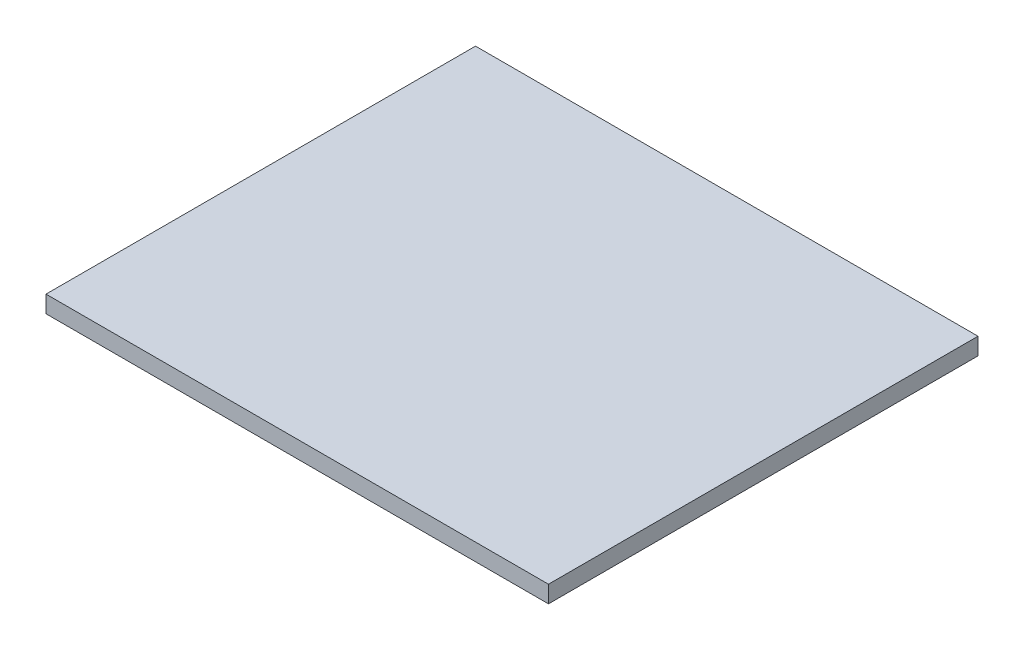
ISO-10303-21;
HEADER;
FILE_DESCRIPTION(('STEP AP214'),'2;1');
FILE_NAME('part.step','',(''),(''),'','','');
FILE_SCHEMA(('AUTOMOTIVE_DESIGN { 1 0 10303 214 1 1 1 1 }'));
ENDSEC;
DATA;
#1=APPLICATION_CONTEXT('core data for automotive mechanical design processes');
#2=APPLICATION_PROTOCOL_DEFINITION('international standard','automotive_design',2000,#1);
#3=PRODUCT_CONTEXT('',#1,'mechanical');
#4=PRODUCT('Part','Part','',(#3));
#5=PRODUCT_RELATED_PRODUCT_CATEGORY('part','',(#4));
#6=PRODUCT_DEFINITION_FORMATION('','',#4);
#7=PRODUCT_DEFINITION_CONTEXT('part definition',#1,'design');
#8=PRODUCT_DEFINITION('design','',#6,#7);
#9=PRODUCT_DEFINITION_SHAPE('','',#8);
#10=(LENGTH_UNIT() NAMED_UNIT(*) SI_UNIT(.MILLI.,.METRE.));
#11=(NAMED_UNIT(*) PLANE_ANGLE_UNIT() SI_UNIT($,.RADIAN.));
#12=(NAMED_UNIT(*) SI_UNIT($,.STERADIAN.) SOLID_ANGLE_UNIT());
#13=UNCERTAINTY_MEASURE_WITH_UNIT(LENGTH_MEASURE(1.E-05),#10,'distance_accuracy_value','');
#14=(GEOMETRIC_REPRESENTATION_CONTEXT(3) GLOBAL_UNCERTAINTY_ASSIGNED_CONTEXT((#13)) GLOBAL_UNIT_ASSIGNED_CONTEXT((#10,
#11,#12)) REPRESENTATION_CONTEXT('',''));
#15=CARTESIAN_POINT('',(0.,0.,0.));
#16=DIRECTION('',(0.,0.,1.));
#17=DIRECTION('',(1.,0.,0.));
#18=AXIS2_PLACEMENT_3D('',#15,#16,#17);
#19=CARTESIAN_POINT('',(-280.,20.,-239.354838709677));
#20=DIRECTION('',(1.,0.,0.));
#21=DIRECTION('',(0.,0.,-1.));
#22=AXIS2_PLACEMENT_3D('',#19,#20,#21);
#23=PLANE('',#22);
#24=DIRECTION('',(0.,0.,1.));
#25=VECTOR('',#24,1.);
#26=CARTESIAN_POINT('',(-280.,0.,-239.354838709677));
#27=LINE('',#26,#25);
#28=CARTESIAN_POINT('',(-280.,0.,-239.354838709677));
#29=VERTEX_POINT('',#28);
#30=CARTESIAN_POINT('',(-280.,0.,265.));
#31=VERTEX_POINT('',#30);
#32=EDGE_CURVE('E107',#29,#31,#27,.T.);
#33=ORIENTED_EDGE('',*,*,#32,.T.);
#34=DIRECTION('',(0.,-1.,0.));
#35=VECTOR('',#34,1.);
#36=CARTESIAN_POINT('',(-280.,20.,265.));
#37=LINE('',#36,#35);
#38=CARTESIAN_POINT('',(-280.,20.,265.));
#39=VERTEX_POINT('',#38);
#40=EDGE_CURVE('E11',#39,#31,#37,.T.);
#41=ORIENTED_EDGE('',*,*,#40,.F.);
#42=DIRECTION('',(0.,0.,1.));
#43=VECTOR('',#42,1.);
#44=CARTESIAN_POINT('',(-280.,20.,-239.354838709677));
#45=LINE('',#44,#43);
#46=CARTESIAN_POINT('',(-280.,20.,-239.354838709677));
#47=VERTEX_POINT('',#46);
#48=EDGE_CURVE('E91',#47,#39,#45,.T.);
#49=ORIENTED_EDGE('',*,*,#48,.F.);
#50=DIRECTION('',(0.,-1.,0.));
#51=VECTOR('',#50,1.);
#52=CARTESIAN_POINT('',(-280.,20.,-239.354838709677));
#53=LINE('',#52,#51);
#54=EDGE_CURVE('E103',#47,#29,#53,.T.);
#55=ORIENTED_EDGE('',*,*,#54,.T.);
#56=EDGE_LOOP('',(#33,#41,#49,#55));
#57=FACE_BOUND('',#56,.T.);
#58=ADVANCED_FACE('F39',(#57),#23,.F.);
#59=CARTESIAN_POINT('',(310.,20.,265.));
#60=DIRECTION('',(0.,0.,-1.));
#61=DIRECTION('',(-1.,0.,0.));
#62=AXIS2_PLACEMENT_3D('',#59,#60,#61);
#63=PLANE('',#62);
#64=DIRECTION('',(1.,0.,0.));
#65=VECTOR('',#64,1.);
#66=CARTESIAN_POINT('',(310.,0.,265.));
#67=LINE('',#66,#65);
#68=CARTESIAN_POINT('',(310.,0.,265.));
#69=VERTEX_POINT('',#68);
#70=EDGE_CURVE('E96',#31,#69,#67,.T.);
#71=ORIENTED_EDGE('',*,*,#70,.T.);
#72=DIRECTION('',(0.,-1.,0.));
#73=VECTOR('',#72,1.);
#74=CARTESIAN_POINT('',(310.,20.,265.));
#75=LINE('',#74,#73);
#76=CARTESIAN_POINT('',(310.,20.,265.));
#77=VERTEX_POINT('',#76);
#78=EDGE_CURVE('E48',#77,#69,#75,.T.);
#79=ORIENTED_EDGE('',*,*,#78,.F.);
#80=DIRECTION('',(1.,0.,0.));
#81=VECTOR('',#80,1.);
#82=CARTESIAN_POINT('',(310.,20.,265.));
#83=LINE('',#82,#81);
#84=EDGE_CURVE('E86',#39,#77,#83,.T.);
#85=ORIENTED_EDGE('',*,*,#84,.F.);
#86=ORIENTED_EDGE('',*,*,#40,.T.);
#87=EDGE_LOOP('',(#71,#79,#85,#86));
#88=FACE_BOUND('',#87,.T.);
#89=ADVANCED_FACE('F95',(#88),#63,.F.);
#90=CARTESIAN_POINT('',(310.,20.,265.));
#91=DIRECTION('',(-1.,0.,0.));
#92=DIRECTION('',(0.,0.,1.));
#93=AXIS2_PLACEMENT_3D('',#90,#91,#92);
#94=PLANE('',#93);
#95=DIRECTION('',(0.,0.,-1.));
#96=VECTOR('',#95,1.);
#97=CARTESIAN_POINT('',(310.,0.,265.));
#98=LINE('',#97,#96);
#99=CARTESIAN_POINT('',(310.,0.,-239.354838709677));
#100=VERTEX_POINT('',#99);
#101=EDGE_CURVE('E73',#69,#100,#98,.T.);
#102=ORIENTED_EDGE('',*,*,#101,.T.);
#103=DIRECTION('',(0.,-1.,0.));
#104=VECTOR('',#103,1.);
#105=CARTESIAN_POINT('',(310.,20.,-239.354838709677));
#106=LINE('',#105,#104);
#107=CARTESIAN_POINT('',(310.,20.,-239.354838709677));
#108=VERTEX_POINT('',#107);
#109=EDGE_CURVE('E98',#108,#100,#106,.T.);
#110=ORIENTED_EDGE('',*,*,#109,.F.);
#111=DIRECTION('',(0.,0.,-1.));
#112=VECTOR('',#111,1.);
#113=CARTESIAN_POINT('',(310.,20.,265.));
#114=LINE('',#113,#112);
#115=EDGE_CURVE('E89',#77,#108,#114,.T.);
#116=ORIENTED_EDGE('',*,*,#115,.F.);
#117=ORIENTED_EDGE('',*,*,#78,.T.);
#118=EDGE_LOOP('',(#102,#110,#116,#117));
#119=FACE_BOUND('',#118,.T.);
#120=ADVANCED_FACE('F99',(#119),#94,.F.);
#121=CARTESIAN_POINT('',(310.,20.,-239.354838709677));
#122=DIRECTION('',(0.,0.,1.));
#123=DIRECTION('',(1.,0.,0.));
#124=AXIS2_PLACEMENT_3D('',#121,#122,#123);
#125=PLANE('',#124);
#126=DIRECTION('',(-1.,0.,0.));
#127=VECTOR('',#126,1.);
#128=CARTESIAN_POINT('',(310.,0.,-239.354838709677));
#129=LINE('',#128,#127);
#130=EDGE_CURVE('E79',#100,#29,#129,.T.);
#131=ORIENTED_EDGE('',*,*,#130,.T.);
#132=ORIENTED_EDGE('',*,*,#54,.F.);
#133=DIRECTION('',(-1.,0.,0.));
#134=VECTOR('',#133,1.);
#135=CARTESIAN_POINT('',(310.,20.,-239.354838709677));
#136=LINE('',#135,#134);
#137=EDGE_CURVE('E56',#108,#47,#136,.T.);
#138=ORIENTED_EDGE('',*,*,#137,.F.);
#139=ORIENTED_EDGE('',*,*,#109,.T.);
#140=EDGE_LOOP('',(#131,#132,#138,#139));
#141=FACE_BOUND('',#140,.T.);
#142=ADVANCED_FACE('F120',(#141),#125,.F.);
#143=CARTESIAN_POINT('',(0.,20.,0.));
#144=DIRECTION('',(0.,-1.,0.));
#145=DIRECTION('',(0.,0.,-1.));
#146=AXIS2_PLACEMENT_3D('',#143,#144,#145);
#147=PLANE('',#146);
#148=ORIENTED_EDGE('',*,*,#48,.T.);
#149=ORIENTED_EDGE('',*,*,#84,.T.);
#150=ORIENTED_EDGE('',*,*,#115,.T.);
#151=ORIENTED_EDGE('',*,*,#137,.T.);
#152=EDGE_LOOP('',(#148,#149,#150,#151));
#153=FACE_BOUND('',#152,.T.);
#154=ADVANCED_FACE('F87',(#153),#147,.F.);
#155=CARTESIAN_POINT('',(0.,0.,0.));
#156=DIRECTION('',(0.,-1.,0.));
#157=DIRECTION('',(0.,0.,-1.));
#158=AXIS2_PLACEMENT_3D('',#155,#156,#157);
#159=PLANE('',#158);
#160=ORIENTED_EDGE('',*,*,#32,.F.);
#161=ORIENTED_EDGE('',*,*,#130,.F.);
#162=ORIENTED_EDGE('',*,*,#101,.F.);
#163=ORIENTED_EDGE('',*,*,#70,.F.);
#164=EDGE_LOOP('',(#160,#161,#162,#163));
#165=FACE_BOUND('',#164,.T.);
#166=ADVANCED_FACE('F123',(#165),#159,.T.);
#167=CLOSED_SHELL('',(#58,#89,#120,#142,#154,#166));
#168=MANIFOLD_SOLID_BREP('B2',#167);
#169=ADVANCED_BREP_SHAPE_REPRESENTATION('',(#18,#168),#14);
#170=SHAPE_DEFINITION_REPRESENTATION(#9,#169);
ENDSEC;
END-ISO-10303-21;
